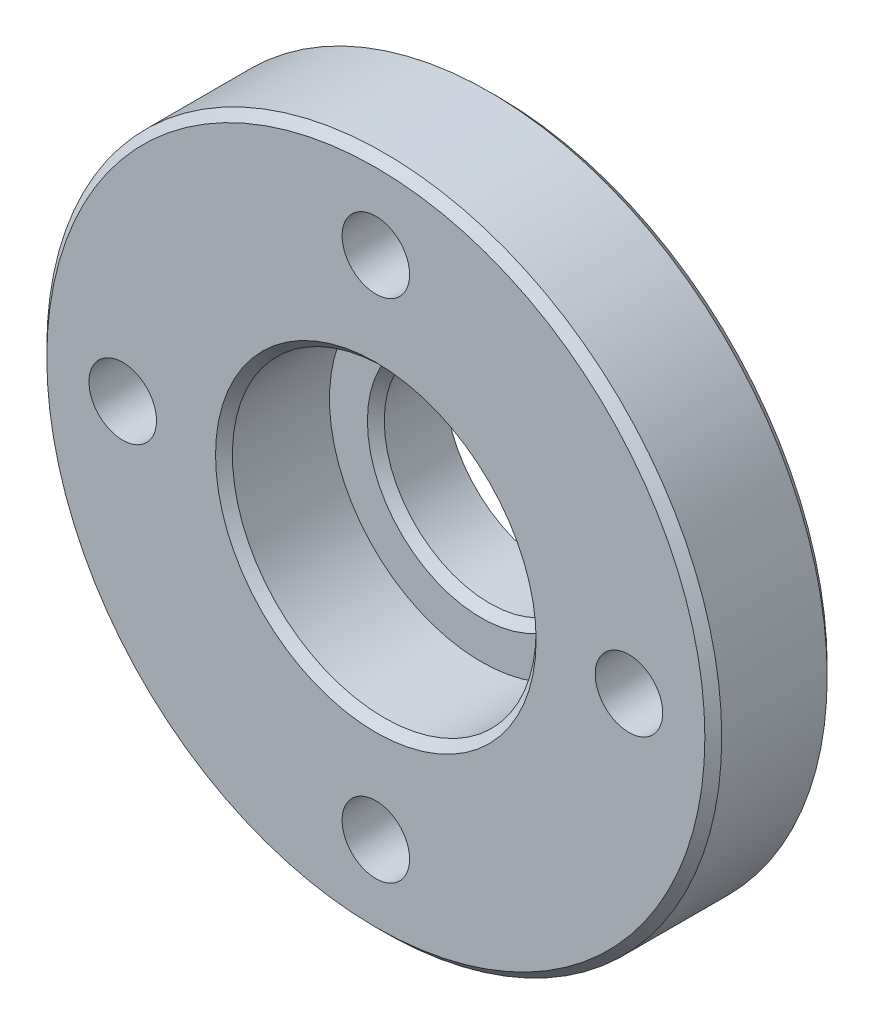
ISO-10303-21;
HEADER;
FILE_DESCRIPTION(('STEP AP214'),'2;1');
FILE_NAME('part.step','',(''),(''),'','','');
FILE_SCHEMA(('AUTOMOTIVE_DESIGN { 1 0 10303 214 1 1 1 1 }'));
ENDSEC;
DATA;
#1=APPLICATION_CONTEXT('core data for automotive mechanical design processes');
#2=APPLICATION_PROTOCOL_DEFINITION('international standard','automotive_design',2000,#1);
#3=PRODUCT_CONTEXT('',#1,'mechanical');
#4=PRODUCT('Part','Part','',(#3));
#5=PRODUCT_RELATED_PRODUCT_CATEGORY('part','',(#4));
#6=PRODUCT_DEFINITION_FORMATION('','',#4);
#7=PRODUCT_DEFINITION_CONTEXT('part definition',#1,'design');
#8=PRODUCT_DEFINITION('design','',#6,#7);
#9=PRODUCT_DEFINITION_SHAPE('','',#8);
#10=(LENGTH_UNIT() NAMED_UNIT(*) SI_UNIT(.MILLI.,.METRE.));
#11=(NAMED_UNIT(*) PLANE_ANGLE_UNIT() SI_UNIT($,.RADIAN.));
#12=(NAMED_UNIT(*) SI_UNIT($,.STERADIAN.) SOLID_ANGLE_UNIT());
#13=UNCERTAINTY_MEASURE_WITH_UNIT(LENGTH_MEASURE(1.E-05),#10,'distance_accuracy_value','');
#14=(GEOMETRIC_REPRESENTATION_CONTEXT(3) GLOBAL_UNCERTAINTY_ASSIGNED_CONTEXT((#13)) GLOBAL_UNIT_ASSIGNED_CONTEXT((#10,
#11,#12)) REPRESENTATION_CONTEXT('',''));
#15=CARTESIAN_POINT('',(0.,0.,0.));
#16=DIRECTION('',(0.,0.,1.));
#17=DIRECTION('',(1.,0.,0.));
#18=AXIS2_PLACEMENT_3D('',#15,#16,#17);
#19=CARTESIAN_POINT('',(0.,0.,0.4));
#20=DIRECTION('',(0.,0.,1.));
#21=DIRECTION('',(1.,0.,0.));
#22=AXIS2_PLACEMENT_3D('',#19,#20,#21);
#23=PLANE('',#22);
#24=CARTESIAN_POINT('',(0.,0.,0.400000000013279));
#25=DIRECTION('',(0.,0.,1.));
#26=DIRECTION('',(1.,0.,0.));
#27=AXIS2_PLACEMENT_3D('',#24,#25,#26);
#28=CIRCLE('',#27,2.70000000000437);
#29=CARTESIAN_POINT('',(2.70000000000437,0.,0.400000000013279));
#30=VERTEX_POINT('',#29);
#31=EDGE_CURVE('E232',#30,#30,#28,.F.);
#32=ORIENTED_EDGE('',*,*,#31,.T.);
#33=EDGE_LOOP('',(#32));
#34=FACE_BOUND('',#33,.T.);
#35=CARTESIAN_POINT('',(0.,0.,0.4));
#36=DIRECTION('',(0.,0.,1.));
#37=DIRECTION('',(1.,0.,0.));
#38=AXIS2_PLACEMENT_3D('',#35,#36,#37);
#39=CIRCLE('',#38,3.6);
#40=CARTESIAN_POINT('',(3.6,0.,0.4));
#41=VERTEX_POINT('',#40);
#42=EDGE_CURVE('E238',#41,#41,#39,.T.);
#43=ORIENTED_EDGE('',*,*,#42,.T.);
#44=EDGE_LOOP('',(#43));
#45=FACE_BOUND('',#44,.T.);
#46=ADVANCED_FACE('F16',(#34,#45),#23,.T.);
#47=CARTESIAN_POINT('',(0.,0.,0.399999999956435));
#48=DIRECTION('',(0.,0.,1.));
#49=DIRECTION('',(1.,0.,0.));
#50=AXIS2_PLACEMENT_3D('',#47,#48,#49);
#51=CONICAL_SURFACE('',#50,2.69999999994752,0.785398163397448);
#52=ORIENTED_EDGE('',*,*,#31,.F.);
#53=EDGE_LOOP('',(#52));
#54=FACE_BOUND('',#53,.T.);
#55=CARTESIAN_POINT('',(0.,0.,0.2));
#56=DIRECTION('',(0.,0.,1.));
#57=DIRECTION('',(1.,0.,0.));
#58=AXIS2_PLACEMENT_3D('',#55,#56,#57);
#59=CIRCLE('',#58,2.5);
#60=CARTESIAN_POINT('',(2.5,0.,0.2));
#61=VERTEX_POINT('',#60);
#62=EDGE_CURVE('E235',#61,#61,#59,.F.);
#63=ORIENTED_EDGE('',*,*,#62,.T.);
#64=EDGE_LOOP('',(#63));
#65=FACE_BOUND('',#64,.T.);
#66=ADVANCED_FACE('F112',(#54,#65),#51,.F.);
#67=CARTESIAN_POINT('',(0.,0.,2.9));
#68=DIRECTION('',(0.,0.,1.));
#69=DIRECTION('',(1.,0.,0.));
#70=AXIS2_PLACEMENT_3D('',#67,#68,#69);
#71=CYLINDRICAL_SURFACE('',#70,3.6);
#72=ORIENTED_EDGE('',*,*,#42,.F.);
#73=EDGE_LOOP('',(#72));
#74=FACE_BOUND('',#73,.T.);
#75=CARTESIAN_POINT('',(0.,0.,2.70000000000437));
#76=DIRECTION('',(0.,0.,1.));
#77=DIRECTION('',(0.,-1.,0.));
#78=AXIS2_PLACEMENT_3D('',#75,#76,#77);
#79=CIRCLE('',#78,3.59999999994898);
#80=CARTESIAN_POINT('',(0.,-3.59999999994898,2.70000000000437));
#81=VERTEX_POINT('',#80);
#82=EDGE_CURVE('E237',#81,#81,#79,.T.);
#83=ORIENTED_EDGE('',*,*,#82,.T.);
#84=EDGE_LOOP('',(#83));
#85=FACE_BOUND('',#84,.T.);
#86=ADVANCED_FACE('F109',(#74,#85),#71,.F.);
#87=CARTESIAN_POINT('',(0.,0.,2.9));
#88=DIRECTION('',(0.,0.,1.));
#89=DIRECTION('',(1.,0.,0.));
#90=AXIS2_PLACEMENT_3D('',#87,#88,#89);
#91=CYLINDRICAL_SURFACE('',#90,2.5);
#92=CARTESIAN_POINT('',(0.,0.,-1.25));
#93=DIRECTION('',(0.,0.,1.));
#94=DIRECTION('',(1.,0.,0.));
#95=AXIS2_PLACEMENT_3D('',#92,#93,#94);
#96=CIRCLE('',#95,2.5);
#97=CARTESIAN_POINT('',(2.5,0.,-1.25));
#98=VERTEX_POINT('',#97);
#99=EDGE_CURVE('E241',#98,#98,#96,.T.);
#100=ORIENTED_EDGE('',*,*,#99,.F.);
#101=EDGE_LOOP('',(#100));
#102=FACE_BOUND('',#101,.T.);
#103=ORIENTED_EDGE('',*,*,#62,.F.);
#104=EDGE_LOOP('',(#103));
#105=FACE_BOUND('',#104,.T.);
#106=ADVANCED_FACE('F105',(#102,#105),#91,.F.);
#107=CARTESIAN_POINT('',(0.,0.,2.69999999999999));
#108=DIRECTION('',(0.,0.,-1.));
#109=DIRECTION('',(-1.,0.,0.));
#110=AXIS2_PLACEMENT_3D('',#107,#108,#109);
#111=CONICAL_SURFACE('',#110,7.99999999999998,0.785398163397299);
#112=CARTESIAN_POINT('',(0.,0.,2.7));
#113=DIRECTION('',(0.,0.,1.));
#114=DIRECTION('',(1.,0.,0.));
#115=AXIS2_PLACEMENT_3D('',#112,#113,#114);
#116=CIRCLE('',#115,8.);
#117=CARTESIAN_POINT('',(8.,0.,2.7));
#118=VERTEX_POINT('',#117);
#119=EDGE_CURVE('E283',#118,#118,#116,.F.);
#120=ORIENTED_EDGE('',*,*,#119,.F.);
#121=EDGE_LOOP('',(#120));
#122=FACE_BOUND('',#121,.T.);
#123=CARTESIAN_POINT('',(0.,0.,2.90000000000002));
#124=DIRECTION('',(0.,0.,-1.));
#125=DIRECTION('',(-1.,0.,0.));
#126=AXIS2_PLACEMENT_3D('',#123,#124,#125);
#127=CIRCLE('',#126,7.80000000000001);
#128=CARTESIAN_POINT('',(-7.80000000000001,0.,2.90000000000002));
#129=VERTEX_POINT('',#128);
#130=EDGE_CURVE('E280',#129,#129,#127,.F.);
#131=ORIENTED_EDGE('',*,*,#130,.F.);
#132=EDGE_LOOP('',(#131));
#133=FACE_BOUND('',#132,.T.);
#134=ADVANCED_FACE('F101',(#122,#133),#111,.T.);
#135=CARTESIAN_POINT('',(0.,0.,2.89999999989732));
#136=DIRECTION('',(0.,0.,1.));
#137=DIRECTION('',(1.,0.,0.));
#138=AXIS2_PLACEMENT_3D('',#135,#136,#137);
#139=CONICAL_SURFACE('',#138,3.79999999984193,0.785398163539557);
#140=ORIENTED_EDGE('',*,*,#82,.F.);
#141=EDGE_LOOP('',(#140));
#142=FACE_BOUND('',#141,.T.);
#143=CARTESIAN_POINT('',(0.,0.,2.900000000011));
#144=DIRECTION('',(0.,0.,1.));
#145=DIRECTION('',(1.,0.,0.));
#146=AXIS2_PLACEMENT_3D('',#143,#144,#145);
#147=CIRCLE('',#146,3.79999999995562);
#148=CARTESIAN_POINT('',(3.79999999995562,0.,2.900000000011));
#149=VERTEX_POINT('',#148);
#150=EDGE_CURVE('E277',#149,#149,#147,.F.);
#151=ORIENTED_EDGE('',*,*,#150,.F.);
#152=EDGE_LOOP('',(#151));
#153=FACE_BOUND('',#152,.T.);
#154=ADVANCED_FACE('F97',(#142,#153),#139,.F.);
#155=CARTESIAN_POINT('',(0.,0.,-1.25));
#156=DIRECTION('',(0.,0.,-1.));
#157=DIRECTION('',(-1.,0.,0.));
#158=AXIS2_PLACEMENT_3D('',#155,#156,#157);
#159=PLANE('',#158);
#160=ORIENTED_EDGE('',*,*,#99,.T.);
#161=EDGE_LOOP('',(#160));
#162=FACE_BOUND('',#161,.T.);
#163=CARTESIAN_POINT('',(0.,0.,-1.25));
#164=DIRECTION('',(0.,0.,-1.));
#165=DIRECTION('',(-1.,0.,0.));
#166=AXIS2_PLACEMENT_3D('',#163,#164,#165);
#167=CIRCLE('',#166,3.25);
#168=CARTESIAN_POINT('',(-3.25,0.,-1.25));
#169=VERTEX_POINT('',#168);
#170=EDGE_CURVE('E274',#169,#169,#167,.F.);
#171=ORIENTED_EDGE('',*,*,#170,.F.);
#172=EDGE_LOOP('',(#171));
#173=FACE_BOUND('',#172,.T.);
#174=ADVANCED_FACE('F93',(#162,#173),#159,.T.);
#175=CARTESIAN_POINT('',(0.,0.,0.));
#176=DIRECTION('',(0.,0.,1.));
#177=DIRECTION('',(1.,0.,0.));
#178=AXIS2_PLACEMENT_3D('',#175,#176,#177);
#179=CYLINDRICAL_SURFACE('',#178,8.);
#180=CARTESIAN_POINT('',(0.,0.,0.199999999980081));
#181=DIRECTION('',(0.,0.,1.));
#182=DIRECTION('',(0.,-1.,0.));
#183=AXIS2_PLACEMENT_3D('',#180,#181,#182);
#184=CIRCLE('',#183,7.99999999998022);
#185=CARTESIAN_POINT('',(0.,-7.99999999998018,0.19999999998008));
#186=VERTEX_POINT('',#185);
#187=EDGE_CURVE('E273',#186,#186,#184,.F.);
#188=ORIENTED_EDGE('',*,*,#187,.F.);
#189=EDGE_LOOP('',(#188));
#190=FACE_BOUND('',#189,.T.);
#191=ORIENTED_EDGE('',*,*,#119,.T.);
#192=EDGE_LOOP('',(#191));
#193=FACE_BOUND('',#192,.T.);
#194=ADVANCED_FACE('F89',(#190,#193),#179,.T.);
#195=CARTESIAN_POINT('',(0.,0.,2.9));
#196=DIRECTION('',(0.,0.,1.));
#197=DIRECTION('',(1.,0.,0.));
#198=AXIS2_PLACEMENT_3D('',#195,#196,#197);
#199=PLANE('',#198);
#200=ORIENTED_EDGE('',*,*,#150,.T.);
#201=EDGE_LOOP('',(#200));
#202=FACE_BOUND('',#201,.T.);
#203=CARTESIAN_POINT('',(0.,6.,2.9));
#204=DIRECTION('',(0.,0.,1.));
#205=DIRECTION('',(1.,0.,0.));
#206=AXIS2_PLACEMENT_3D('',#203,#204,#205);
#207=CIRCLE('',#206,0.8);
#208=CARTESIAN_POINT('',(0.8,6.,2.9));
#209=VERTEX_POINT('',#208);
#210=EDGE_CURVE('E270',#209,#209,#207,.F.);
#211=ORIENTED_EDGE('',*,*,#210,.T.);
#212=EDGE_LOOP('',(#211));
#213=FACE_BOUND('',#212,.T.);
#214=CARTESIAN_POINT('',(6.,0.,2.9));
#215=DIRECTION('',(0.,0.,1.));
#216=DIRECTION('',(1.,0.,0.));
#217=AXIS2_PLACEMENT_3D('',#214,#215,#216);
#218=CIRCLE('',#217,0.8);
#219=CARTESIAN_POINT('',(6.8,0.,2.9));
#220=VERTEX_POINT('',#219);
#221=EDGE_CURVE('E261',#220,#220,#218,.F.);
#222=ORIENTED_EDGE('',*,*,#221,.T.);
#223=EDGE_LOOP('',(#222));
#224=FACE_BOUND('',#223,.T.);
#225=CARTESIAN_POINT('',(0.,-6.,2.9));
#226=DIRECTION('',(0.,0.,1.));
#227=DIRECTION('',(1.,0.,0.));
#228=AXIS2_PLACEMENT_3D('',#225,#226,#227);
#229=CIRCLE('',#228,0.8);
#230=CARTESIAN_POINT('',(0.8,-6.,2.9));
#231=VERTEX_POINT('',#230);
#232=EDGE_CURVE('E264',#231,#231,#229,.F.);
#233=ORIENTED_EDGE('',*,*,#232,.T.);
#234=EDGE_LOOP('',(#233));
#235=FACE_BOUND('',#234,.T.);
#236=CARTESIAN_POINT('',(-6.,0.,2.9));
#237=DIRECTION('',(0.,0.,1.));
#238=DIRECTION('',(1.,0.,0.));
#239=AXIS2_PLACEMENT_3D('',#236,#237,#238);
#240=CIRCLE('',#239,0.8);
#241=CARTESIAN_POINT('',(-5.2,0.,2.9));
#242=VERTEX_POINT('',#241);
#243=EDGE_CURVE('E267',#242,#242,#240,.F.);
#244=ORIENTED_EDGE('',*,*,#243,.T.);
#245=EDGE_LOOP('',(#244));
#246=FACE_BOUND('',#245,.T.);
#247=ORIENTED_EDGE('',*,*,#130,.T.);
#248=EDGE_LOOP('',(#247));
#249=FACE_BOUND('',#248,.T.);
#250=ADVANCED_FACE('F85',(#202,#213,#224,#235,#246,#249),#199,.T.);
#251=CARTESIAN_POINT('',(0.,0.,0.));
#252=DIRECTION('',(0.,0.,-1.));
#253=DIRECTION('',(-1.,0.,0.));
#254=AXIS2_PLACEMENT_3D('',#251,#252,#253);
#255=CYLINDRICAL_SURFACE('',#254,3.25);
#256=ORIENTED_EDGE('',*,*,#170,.T.);
#257=EDGE_LOOP('',(#256));
#258=FACE_BOUND('',#257,.T.);
#259=CARTESIAN_POINT('',(0.,0.,-0.3));
#260=DIRECTION('',(0.,0.,-1.));
#261=DIRECTION('',(0.999940770988799,0.01088368110184,0.));
#262=AXIS2_PLACEMENT_3D('',#259,#260,#261);
#263=CIRCLE('',#262,3.25);
#264=CARTESIAN_POINT('',(3.2498075057136,0.03537196358098,-0.3));
#265=VERTEX_POINT('',#264);
#266=EDGE_CURVE('E48',#265,#265,#263,.T.);
#267=ORIENTED_EDGE('',*,*,#266,.T.);
#268=EDGE_LOOP('',(#267));
#269=FACE_BOUND('',#268,.T.);
#270=ADVANCED_FACE('F81',(#258,#269),#255,.T.);
#271=CARTESIAN_POINT('',(0.,0.,0.199999999980081));
#272=DIRECTION('',(0.,0.,1.));
#273=DIRECTION('',(1.,0.,0.));
#274=AXIS2_PLACEMENT_3D('',#271,#272,#273);
#275=CONICAL_SURFACE('',#274,7.99999999998022,0.7853981633973);
#276=ORIENTED_EDGE('',*,*,#187,.T.);
#277=EDGE_LOOP('',(#276));
#278=FACE_BOUND('',#277,.T.);
#279=CARTESIAN_POINT('',(0.,0.,-1.05032085459533E-13));
#280=DIRECTION('',(0.,0.,1.));
#281=DIRECTION('',(1.,0.,0.));
#282=AXIS2_PLACEMENT_3D('',#279,#280,#281);
#283=CIRCLE('',#282,7.8000000000001);
#284=CARTESIAN_POINT('',(7.8000000000001,0.,-1.05032085459533E-13));
#285=VERTEX_POINT('',#284);
#286=EDGE_CURVE('E258',#285,#285,#283,.T.);
#287=ORIENTED_EDGE('',*,*,#286,.T.);
#288=EDGE_LOOP('',(#287));
#289=FACE_BOUND('',#288,.T.);
#290=ADVANCED_FACE('F77',(#278,#289),#275,.T.);
#291=CARTESIAN_POINT('',(0.,6.,2.9));
#292=DIRECTION('',(0.,0.,1.));
#293=DIRECTION('',(1.,0.,0.));
#294=AXIS2_PLACEMENT_3D('',#291,#292,#293);
#295=CYLINDRICAL_SURFACE('',#294,0.8);
#296=ORIENTED_EDGE('',*,*,#210,.F.);
#297=EDGE_LOOP('',(#296));
#298=FACE_BOUND('',#297,.T.);
#299=CARTESIAN_POINT('',(0.,6.,0.));
#300=DIRECTION('',(0.,0.,1.));
#301=DIRECTION('',(1.,0.,0.));
#302=AXIS2_PLACEMENT_3D('',#299,#300,#301);
#303=CIRCLE('',#302,0.8);
#304=CARTESIAN_POINT('',(0.8,6.,0.));
#305=VERTEX_POINT('',#304);
#306=EDGE_CURVE('E255',#305,#305,#303,.F.);
#307=ORIENTED_EDGE('',*,*,#306,.T.);
#308=EDGE_LOOP('',(#307));
#309=FACE_BOUND('',#308,.T.);
#310=ADVANCED_FACE('F73',(#298,#309),#295,.F.);
#311=CARTESIAN_POINT('',(-6.,0.,2.9));
#312=DIRECTION('',(0.,0.,1.));
#313=DIRECTION('',(1.,0.,0.));
#314=AXIS2_PLACEMENT_3D('',#311,#312,#313);
#315=CYLINDRICAL_SURFACE('',#314,0.8);
#316=ORIENTED_EDGE('',*,*,#243,.F.);
#317=EDGE_LOOP('',(#316));
#318=FACE_BOUND('',#317,.T.);
#319=CARTESIAN_POINT('',(-6.,0.,0.));
#320=DIRECTION('',(0.,0.,1.));
#321=DIRECTION('',(1.,0.,0.));
#322=AXIS2_PLACEMENT_3D('',#319,#320,#321);
#323=CIRCLE('',#322,0.8);
#324=CARTESIAN_POINT('',(-5.2,0.,0.));
#325=VERTEX_POINT('',#324);
#326=EDGE_CURVE('E252',#325,#325,#323,.F.);
#327=ORIENTED_EDGE('',*,*,#326,.T.);
#328=EDGE_LOOP('',(#327));
#329=FACE_BOUND('',#328,.T.);
#330=ADVANCED_FACE('F69',(#318,#329),#315,.F.);
#331=CARTESIAN_POINT('',(0.,-6.,2.9));
#332=DIRECTION('',(0.,0.,1.));
#333=DIRECTION('',(1.,0.,0.));
#334=AXIS2_PLACEMENT_3D('',#331,#332,#333);
#335=CYLINDRICAL_SURFACE('',#334,0.8);
#336=ORIENTED_EDGE('',*,*,#232,.F.);
#337=EDGE_LOOP('',(#336));
#338=FACE_BOUND('',#337,.T.);
#339=CARTESIAN_POINT('',(0.,-6.,0.));
#340=DIRECTION('',(0.,0.,1.));
#341=DIRECTION('',(1.,0.,0.));
#342=AXIS2_PLACEMENT_3D('',#339,#340,#341);
#343=CIRCLE('',#342,0.8);
#344=CARTESIAN_POINT('',(0.8,-6.,0.));
#345=VERTEX_POINT('',#344);
#346=EDGE_CURVE('E249',#345,#345,#343,.F.);
#347=ORIENTED_EDGE('',*,*,#346,.T.);
#348=EDGE_LOOP('',(#347));
#349=FACE_BOUND('',#348,.T.);
#350=ADVANCED_FACE('F65',(#338,#349),#335,.F.);
#351=CARTESIAN_POINT('',(6.,0.,2.9));
#352=DIRECTION('',(0.,0.,1.));
#353=DIRECTION('',(1.,0.,0.));
#354=AXIS2_PLACEMENT_3D('',#351,#352,#353);
#355=CYLINDRICAL_SURFACE('',#354,0.8);
#356=ORIENTED_EDGE('',*,*,#221,.F.);
#357=EDGE_LOOP('',(#356));
#358=FACE_BOUND('',#357,.T.);
#359=CARTESIAN_POINT('',(6.,0.,0.));
#360=DIRECTION('',(0.,0.,1.));
#361=DIRECTION('',(1.,0.,0.));
#362=AXIS2_PLACEMENT_3D('',#359,#360,#361);
#363=CIRCLE('',#362,0.8);
#364=CARTESIAN_POINT('',(6.8,0.,0.));
#365=VERTEX_POINT('',#364);
#366=EDGE_CURVE('E37',#365,#365,#363,.F.);
#367=ORIENTED_EDGE('',*,*,#366,.T.);
#368=EDGE_LOOP('',(#367));
#369=FACE_BOUND('',#368,.T.);
#370=ADVANCED_FACE('F59',(#358,#369),#355,.F.);
#371=CARTESIAN_POINT('',(0.,0.,-0.3));
#372=DIRECTION('',(0.,0.,-1.));
#373=DIRECTION('',(0.999940770988799,0.01088368110184,0.));
#374=AXIS2_PLACEMENT_3D('',#371,#372,#373);
#375=TOROIDAL_SURFACE('',#374,3.55,0.3);
#376=ORIENTED_EDGE('',*,*,#266,.F.);
#377=EDGE_LOOP('',(#376));
#378=FACE_BOUND('',#377,.T.);
#379=CARTESIAN_POINT('',(-3.55,0.,0.));
#380=CARTESIAN_POINT('',(-3.55000177731939,0.0637241145299404,-1.15818897850396E-12));
#381=CARTESIAN_POINT('',(-3.5482842494849,0.127448068084075,-5.79094489251971E-13));
#382=CARTESIAN_POINT('',(-3.54142337553553,0.254711311922814,5.79094489251957E-13));
#383=CARTESIAN_POINT('',(-3.53628002942065,0.318250602207417,1.1581889785039E-12));
#384=CARTESIAN_POINT('',(-3.52258031093787,0.444960178189175,-1.15818897850391E-12));
#385=CARTESIAN_POINT('',(-3.51402393856997,0.508130463886329,-4.05366142476369E-12));
#386=CARTESIAN_POINT('',(-3.49352364176005,0.633918969987206,4.05366142476372E-12));
#387=CARTESIAN_POINT('',(-3.48157971731803,0.696537190390929,1.5056456720551E-11));
#388=CARTESIAN_POINT('',(-3.45433839667815,0.821039798081064,-1.5056456720551E-11));
#389=CARTESIAN_POINT('',(-3.43904100048029,0.882924185367477,-5.61721654574404E-11));
#390=CARTESIAN_POINT('',(-3.40513861336321,1.00578050659713,5.617216545744E-11));
#391=CARTESIAN_POINT('',(-3.38653362244399,1.06675244054038,2.09632205109208E-10));
#392=CARTESIAN_POINT('',(-3.34606443124309,1.18760410789843,-2.0963220510921E-10));
#393=CARTESIAN_POINT('',(-3.3242002309614,1.24748384131324,-7.82356654979402E-10));
#394=CARTESIAN_POINT('',(-3.27534501770986,1.37091966338149,8.47465484120062E-10));
#395=CARTESIAN_POINT('',(-3.24807877129513,1.43436698821757,3.28494063787882E-09));
#396=CARTESIAN_POINT('',(-3.18994018159506,1.55958088666768,-1.68526873742431E-08));
#397=CARTESIAN_POINT('',(-3.15906804287705,1.62134755538282,-3.94263722377806E-08));
#398=CARTESIAN_POINT('',(-3.09380591317326,1.74299714369993,-1.7766528811329E-07));
#399=CARTESIAN_POINT('',(-3.05941599394825,1.80288010169599,-2.93328620478269E-07));
#400=CARTESIAN_POINT('',(-3.0052987387991,1.89114166299074,-6.77625014708268E-07));
#401=CARTESIAN_POINT('',(-2.98683649181178,1.92030328537957,-8.40872348222431E-07));
#402=CARTESIAN_POINT('',(-2.94903488667074,1.97811060751163,-1.19546224709107E-06));
#403=CARTESIAN_POINT('',(-2.92969437392821,2.00675555463798,-1.38684258176955E-06));
#404=CARTESIAN_POINT('',(-2.89015697340309,2.06344350864992,-1.66771507711628E-06));
#405=CARTESIAN_POINT('',(-2.86996017540166,2.09148657818003,-1.75721789233265E-06));
#406=CARTESIAN_POINT('',(-2.82873492560694,2.14694885339521,-1.82873367137051E-06));
#407=CARTESIAN_POINT('',(-2.80770658288133,2.17436814015904,-1.81076068586432E-06));
#408=CARTESIAN_POINT('',(-2.76483802515553,2.22855779997896,-1.66637109867364E-06));
#409=CARTESIAN_POINT('',(-2.74299793802908,2.25532827415373,-1.53997150869894E-06));
#410=CARTESIAN_POINT('',(-2.69852165866472,2.30819044400974,-1.21850937570022E-06));
#411=CARTESIAN_POINT('',(-2.67588561284884,2.33428226301374,-1.02345940251952E-06));
#412=CARTESIAN_POINT('',(-2.62985888805577,2.38578355967928,-6.20430811251164E-07));
#413=CARTESIAN_POINT('',(-2.60646836789488,2.4111931789064,-4.1245490562988E-07));
#414=CARTESIAN_POINT('',(-2.55887997320061,2.46123022017958,-1.18301947865976E-07));
#415=CARTESIAN_POINT('',(-2.53468228992083,2.48585782485858,-3.20962497413241E-08));
#416=CARTESIAN_POINT('',(-2.4841475754044,2.53622314458885,3.42334620939457E-08));
#417=CARTESIAN_POINT('',(-2.45777538043851,2.56192558267282,6.91152244491008E-09));
#418=CARTESIAN_POINT('',(-2.3998693227056,2.616542642101,-4.95659777531426E-08));
#419=CARTESIAN_POINT('',(-2.36819064328081,2.64530421951728,-7.83030811157306E-08));
#420=CARTESIAN_POINT('',(-2.29160752364961,2.71239043402949,-2.11084940115141E-07));
#421=CARTESIAN_POINT('',(-2.24624909409337,2.75019881064029,-3.39584135117191E-07));
#422=CARTESIAN_POINT('',(-2.17137199291873,2.80948258064084,-5.81354236625687E-07));
#423=CARTESIAN_POINT('',(-2.1424218581969,2.83167972986692,-6.81689288823034E-07));
#424=CARTESIAN_POINT('',(-2.08499766189925,2.87429756359424,-8.49541711906673E-07));
#425=CARTESIAN_POINT('',(-2.05654995789573,2.8947537852614,-9.18198737410651E-07));
#426=CARTESIAN_POINT('',(-1.97384746437623,2.95234504136531,-1.03122083047378E-06));
#427=CARTESIAN_POINT('',(-1.91882489794451,2.98838581197177,-1.00156539164942E-06));
#428=CARTESIAN_POINT('',(-1.8049964531791,3.05845578877419,-8.44033963982997E-07));
#429=CARTESIAN_POINT('',(-1.74612564175505,3.09237926660823,-7.12946835976197E-07));
#430=CARTESIAN_POINT('',(-1.62654181609905,3.15680175335607,-5.02277570184485E-07));
#431=CARTESIAN_POINT('',(-1.56582888055403,3.18730090828008,-4.22693235674613E-07));
#432=CARTESIAN_POINT('',(-1.44275562483144,3.24476212547531,-2.77333094699466E-07));
#433=CARTESIAN_POINT('',(-1.38039537722763,3.27172434325814,-2.11556681052858E-07));
#434=CARTESIAN_POINT('',(-1.25422938614281,3.32202275414751,-1.04718086178292E-07));
#435=CARTESIAN_POINT('',(-1.19042370828533,3.34535911149406,-6.36547852822273E-08));
#436=CARTESIAN_POINT('',(-1.08507570668033,3.38050955568597,-2.34269800843127E-08));
#437=CARTESIAN_POINT('',(-1.04389627571688,3.39342288937346,-1.44457256937382E-08));
#438=CARTESIAN_POINT('',(-0.953228477835695,3.42006279339279,-2.50184719983134E-09));
#439=CARTESIAN_POINT('',(-0.90364812074177,3.43347763472006,-1.00715343449795E-09));
#440=CARTESIAN_POINT('',(-0.795991015026159,3.46012090570565,3.06871530800147E-10));
#441=CARTESIAN_POINT('',(-0.737821639981949,3.47297758720789,-1.7939878727623E-10));
#442=CARTESIAN_POINT('',(-0.647125712407379,3.49064870948649,-1.02749789198083E-09));
#443=CARTESIAN_POINT('',(-0.614794459308092,3.4964845753852,-1.34738068054071E-09));
#444=CARTESIAN_POINT('',(-0.547959372736178,3.50759476747818,-1.85514224118616E-09));
#445=CARTESIAN_POINT('',(-0.513445870685233,3.51281132300264,-2.03353746534999E-09));
#446=CARTESIAN_POINT('',(-0.442248945818086,3.52250254192202,-2.18607708433094E-09));
#447=CARTESIAN_POINT('',(-0.405557147684807,3.52691562681002,-2.1476081489059E-09));
#448=CARTESIAN_POINT('',(-0.330014456153988,3.53480877462452,-1.87925541843737E-09));
#449=CARTESIAN_POINT('',(-0.291156718934172,3.53822348667447,-1.63886991345723E-09));
#450=CARTESIAN_POINT('',(-0.21130482513067,3.54391788396331,-1.07397095465081E-09));
#451=CARTESIAN_POINT('',(-0.17030573807188,3.54612846878956,-7.45699416632755E-10));
#452=CARTESIAN_POINT('',(-0.0862060050874094,3.54920283023259,-2.05369160839831E-10));
#453=CARTESIAN_POINT('',(-0.0431026643384663,3.54999382998662,0.));
#454=CARTESIAN_POINT('',(0.0331929182439411,3.55000475146381,0.));
#455=CARTESIAN_POINT('',(0.0663854353506584,3.5495440689422,-1.21973843918672E-10));
#456=CARTESIAN_POINT('',(0.132743914901911,3.54769156104033,-5.59541311133321E-10));
#457=CARTESIAN_POINT('',(0.16590987724299,3.54629973204988,-8.75187122074042E-10));
#458=CARTESIAN_POINT('',(0.265328962954708,3.5407289470498,-2.04135333487703E-09));
#459=CARTESIAN_POINT('',(0.331509480959109,3.53515469370643,-3.11112047868067E-09));
#460=CARTESIAN_POINT('',(0.463450077422762,3.52030299291165,-5.5045741415716E-09));
#461=CARTESIAN_POINT('',(0.529210153371818,3.51102552337159,-6.8282621752015E-09));
#462=CARTESIAN_POINT('',(0.660107763448721,3.48879648971472,-9.46077824635219E-09));
#463=CARTESIAN_POINT('',(0.725245294604413,3.47584490806602,-1.07696062129336E-08));
#464=CARTESIAN_POINT('',(0.854691278003871,3.44630843337384,-1.31628632372263E-08));
#465=CARTESIAN_POINT('',(0.918999727279655,3.42972352732745,-1.42472914918313E-08));
#466=CARTESIAN_POINT('',(1.04658533473517,3.39297261354836,-1.60422367450649E-08));
#467=CARTESIAN_POINT('',(1.10986249045399,3.37280659727163,-1.67527528515763E-08));
#468=CARTESIAN_POINT('',(1.23518608973673,3.32895696989726,-1.77099973222359E-08));
#469=CARTESIAN_POINT('',(1.29723253183239,3.30527335460338,-1.79567251331112E-08));
#470=CARTESIAN_POINT('',(1.41989928177309,3.25446312055838,-1.79569301630658E-08));
#471=CARTESIAN_POINT('',(1.48051958961813,3.22733650180727,-1.77104073821452E-08));
#472=CARTESIAN_POINT('',(1.60014312137119,3.16972571571153,-1.67523427921562E-08));
#473=CARTESIAN_POINT('',(1.65914634720822,3.1392415523723,-1.60408015378283E-08));
#474=CARTESIAN_POINT('',(1.77534983363067,3.07501168116599,-1.42487266956436E-08));
#475=CARTESIAN_POINT('',(1.83255009851744,3.04126598108076,-1.31681939881639E-08));
#476=CARTESIAN_POINT('',(1.94496760529197,2.97061945140014,-1.07642754810739E-08));
#477=CARTESIAN_POINT('',(2.00018485427592,2.93371863309687,-9.44089055060849E-09));
#478=CARTESIAN_POINT('',(2.10846199430521,2.85687774342723,-6.84814977604514E-09));
#479=CARTESIAN_POINT('',(2.16152189564378,2.81693768656439,-5.57879367416152E-09));
#480=CARTESIAN_POINT('',(2.26531878444054,2.73414558251219,-3.03690138879347E-09));
#481=CARTESIAN_POINT('',(2.3160557857525,2.69129355269363,-1.76436522432267E-09));
#482=CARTESIAN_POINT('',(2.41504126360067,2.60280720215058,-7.63505054003037E-10));
#483=CARTESIAN_POINT('',(2.46328975794657,2.55717290134329,-1.03516999510199E-09));
#484=CARTESIAN_POINT('',(2.55903774394011,2.46141570989441,1.07639557910747E-09));
#485=CARTESIAN_POINT('',(2.60643088323645,2.41118643861165,3.56578801703429E-09));
#486=CARTESIAN_POINT('',(2.69824696780045,2.30809153825645,-9.43503646450697E-09));
#487=CARTESIAN_POINT('',(2.74267013186683,2.25522610389276,-2.49239273729037E-08));
#488=CARTESIAN_POINT('',(2.82839417372304,2.14701893661742,-1.50691261894333E-07));
#489=CARTESIAN_POINT('',(2.8696951521915,2.09167728364608,-2.60966647583336E-07));
#490=CARTESIAN_POINT('',(2.92921110423253,2.00696447571776,-6.61130125480472E-07));
#491=CARTESIAN_POINT('',(2.94864479612739,1.9784419361985,-8.3365830558018E-07));
#492=CARTESIAN_POINT('',(2.98669133343393,1.92079537416168,-1.21492434559114E-06));
#493=CARTESIAN_POINT('',(3.005302990752,1.89167056498433,-1.42371259430808E-06));
#494=CARTESIAN_POINT('',(3.04163200210205,1.83287304016135,-1.73454573354776E-06));
#495=CARTESIAN_POINT('',(3.05934945323082,1.80320038448325,-1.83660223730304E-06));
#496=CARTESIAN_POINT('',(3.09388015874436,1.74333898952784,-1.92560087813202E-06));
#497=CARTESIAN_POINT('',(3.11069353595039,1.71315032109059,-1.912558691676E-06));
#498=CARTESIAN_POINT('',(3.14340070181252,1.65228501694896,-1.76869931400711E-06));
#499=CARTESIAN_POINT('',(3.15929464044035,1.62160846187152,-1.63790138817654E-06));
#500=CARTESIAN_POINT('',(3.19014209798094,1.55979401212369,-1.30061714509153E-06));
#501=CARTESIAN_POINT('',(3.20509579588864,1.52865620666528,-1.09414528541032E-06));
#502=CARTESIAN_POINT('',(3.23407470597331,1.46595832636389,-6.64902281860711E-07));
#503=CARTESIAN_POINT('',(3.24810012015361,1.43439834519918,-4.42134706454065E-07));
#504=CARTESIAN_POINT('',(3.275114416212,1.37084952013433,-1.27736889410358E-07));
#505=CARTESIAN_POINT('',(3.28810355193197,1.33886078351641,-3.60744391787347E-08));
#506=CARTESIAN_POINT('',(3.31507898132765,1.27032937801481,4.08832426624629E-08));
#507=CARTESIAN_POINT('',(3.32896738811621,1.23374808319761,1.03706912696934E-08));
#508=CARTESIAN_POINT('',(3.35297392880423,1.16704179734255,-2.72148018787002E-08));
#509=CARTESIAN_POINT('',(3.36331008593871,1.13699552918526,-3.76152635380577E-08));
#510=CARTESIAN_POINT('',(3.38610480671591,1.06778117584767,-8.99976570411874E-08));
#511=CARTESIAN_POINT('',(3.39829559643708,1.02852478216756,-1.40354899858709E-07));
#512=CARTESIAN_POINT('',(3.4219943965881,0.947214094876616,-2.64055658436146E-07));
#513=CARTESIAN_POINT('',(3.4334160660091,0.905134589846407,-3.38608739971372E-07));
#514=CARTESIAN_POINT('',(3.45361376694859,0.824831062596008,-4.64559083841783E-07));
#515=CARTESIAN_POINT('',(3.46254034490919,0.786644862077482,-5.1753100521245E-07));
#516=CARTESIAN_POINT('',(3.47677747831248,0.720744894326614,-5.71546189628697E-07));
#517=CARTESIAN_POINT('',(3.48239997179725,0.693098195026021,-5.82987771076266E-07));
#518=CARTESIAN_POINT('',(3.49365668630028,0.634100376800197,-5.84519661099307E-07));
#519=CARTESIAN_POINT('',(3.49919875162348,0.602731705851754,-5.71663489267965E-07));
#520=CARTESIAN_POINT('',(3.51454051255153,0.508422610943938,-5.12098479105241E-07));
#521=CARTESIAN_POINT('',(3.52305796673935,0.445269090812661,-4.44395763923788E-07));
#522=CARTESIAN_POINT('',(3.53666691160319,0.318602426951107,-2.77249717271635E-07));
#523=CARTESIAN_POINT('',(3.54175879649348,0.255089325450023,-1.77810040030717E-07));
#524=CARTESIAN_POINT('',(3.54774616566364,0.14057675879156,-4.83629654622951E-08));
#525=CARTESIAN_POINT('',(3.54927637011468,0.0896098259626175,-8.45885095525965E-09));
#526=CARTESIAN_POINT('',(3.54992838472194,0.0257581830289743,2.03093543540749E-09));
#527=CARTESIAN_POINT('',(3.54999543846752,0.0128788535625361,2.13388395791422E-09));
#528=CARTESIAN_POINT('',(3.55,0.,0.));
#529=B_SPLINE_CURVE_WITH_KNOTS('',3,(#379,#380,#381,#382,#383,#384,#385,#386,#387,#388,#389,
#390,#391,#392,#393,#394,#395,#396,#397,#398,#399,#400,#401,#402,#403,#404,#405,#406,#407,#408,
#409,#410,#411,#412,#413,#414,#415,#416,#417,#418,#419,#420,#421,#422,#423,#424,#425,#426,#427,
#428,#429,#430,#431,#432,#433,#434,#435,#436,#437,#438,#439,#440,#441,#442,#443,#444,#445,#446,
#447,#448,#449,#450,#451,#452,#453,#454,#455,#456,#457,#458,#459,#460,#461,#462,#463,#464,#465,
#466,#467,#468,#469,#470,#471,#472,#473,#474,#475,#476,#477,#478,#479,#480,#481,#482,#483,#484,
#485,#486,#487,#488,#489,#490,#491,#492,#493,#494,#495,#496,#497,#498,#499,#500,#501,#502,#503,
#504,#505,#506,#507,#508,#509,#510,#511,#512,#513,#514,#515,#516,#517,#518,#519,#520,#521,#522,
#523,#524,#525,#526,#527,#528),.UNSPECIFIED.,.F.,.F.,(4,2,2,2,2,2,2,2,2,2,2,2,2,2,2,2,2,2,2,2,2,
2,2,2,2,2,2,2,2,2,2,2,2,2,2,2,2,2,2,2,2,2,2,2,2,2,2,2,2,2,2,2,2,2,2,2,2,2,2,2,2,2,2,2,2,2,2,2,2,
2,2,2,2,2,4),(0.,0.191148976396665,0.382297952793326,0.573446929189988,0.764595905586651,
0.955744881983315,1.14689385837998,1.33804283477664,1.54509949977723,1.75214442386203,
1.9591851251866,2.06271701340177,2.1663891873668,2.27005051809883,2.37369829713334,
2.47732981721079,2.58094237228281,2.68453325752108,2.78809976933355,2.89856252697372,
3.02689610052846,3.20396563934485,3.31339046450802,3.41849343122556,3.6157065705503,
3.81943216003132,4.02314905952569,4.2268569990164,4.43055570848986,4.56000080381403,
4.714042763361,4.89267987939877,4.99123054444173,5.09593131581366,5.20678225877963,
5.32378346206747,5.44693503787678,5.57623712188561,5.6758113261523,5.77538591648416,
5.97451653562419,6.1736483425404,6.37278109967755,6.5719145694804,6.77104851439371,
6.97018269686224,7.16931687933078,7.36845082424408,7.56758429404693,7.76671705118408,
7.96584885810029,8.16497947724033,8.36410867104894,8.57116817325728,8.77821240450001,
8.98524995650253,9.08877965108015,9.19245438404483,9.29611783522929,9.39976716764379,
9.50339954563023,9.60701213486938,9.71060210239125,9.8141666165933,9.93153651233485,
10.0268476448271,10.1501403340743,10.2809157187344,10.3985401064341,10.4831699331999,
10.5787231600198,10.7697989006145,10.9608526484642,11.1137738237551,11.1524115032801),.UNSPECIFIED.);
#530=CARTESIAN_POINT('',(-3.55,0.,0.));
#531=VERTEX_POINT('',#530);
#532=CARTESIAN_POINT('',(3.55,0.,0.));
#533=VERTEX_POINT('',#532);
#534=EDGE_CURVE('E26',#531,#533,#529,.T.);
#535=ORIENTED_EDGE('',*,*,#534,.T.);
#536=CARTESIAN_POINT('',(0.,0.,0.));
#537=DIRECTION('',(0.,0.,-1.));
#538=DIRECTION('',(1.,0.,0.));
#539=AXIS2_PLACEMENT_3D('',#536,#537,#538);
#540=CIRCLE('',#539,3.55);
#541=EDGE_CURVE('E11',#533,#531,#540,.T.);
#542=ORIENTED_EDGE('',*,*,#541,.T.);
#543=EDGE_LOOP('',(#535,#542));
#544=FACE_BOUND('',#543,.T.);
#545=ADVANCED_FACE('F40',(#378,#544),#375,.F.);
#546=CARTESIAN_POINT('',(0.,0.,0.));
#547=DIRECTION('',(0.,0.,1.));
#548=DIRECTION('',(1.,0.,0.));
#549=AXIS2_PLACEMENT_3D('',#546,#547,#548);
#550=PLANE('',#549);
#551=ORIENTED_EDGE('',*,*,#534,.F.);
#552=ORIENTED_EDGE('',*,*,#541,.F.);
#553=EDGE_LOOP('',(#551,#552));
#554=FACE_BOUND('',#553,.T.);
#555=ORIENTED_EDGE('',*,*,#366,.F.);
#556=EDGE_LOOP('',(#555));
#557=FACE_BOUND('',#556,.T.);
#558=ORIENTED_EDGE('',*,*,#346,.F.);
#559=EDGE_LOOP('',(#558));
#560=FACE_BOUND('',#559,.T.);
#561=ORIENTED_EDGE('',*,*,#326,.F.);
#562=EDGE_LOOP('',(#561));
#563=FACE_BOUND('',#562,.T.);
#564=ORIENTED_EDGE('',*,*,#306,.F.);
#565=EDGE_LOOP('',(#564));
#566=FACE_BOUND('',#565,.T.);
#567=ORIENTED_EDGE('',*,*,#286,.F.);
#568=EDGE_LOOP('',(#567));
#569=FACE_BOUND('',#568,.T.);
#570=ADVANCED_FACE('F34',(#554,#557,#560,#563,#566,#569),#550,.F.);
#571=CLOSED_SHELL('',(#46,#66,#86,#106,#134,#154,#174,#194,#250,#270,#290,#310,#330,#350,#370,
#545,#570));
#572=MANIFOLD_SOLID_BREP('B1',#571);
#573=ADVANCED_BREP_SHAPE_REPRESENTATION('',(#18,#572),#14);
#574=SHAPE_DEFINITION_REPRESENTATION(#9,#573);
ENDSEC;
END-ISO-10303-21;
